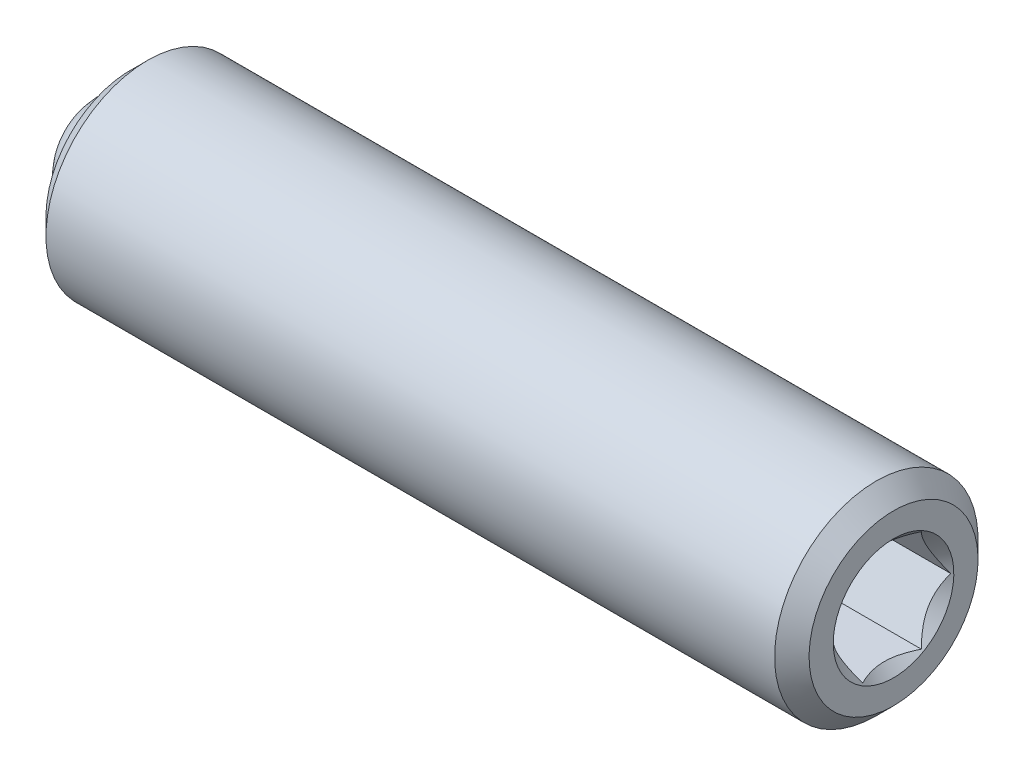
ISO-10303-21;
HEADER;
FILE_DESCRIPTION(('STEP AP214'),'2;1');
FILE_NAME('part.step','',(''),(''),'','','');
FILE_SCHEMA(('AUTOMOTIVE_DESIGN { 1 0 10303 214 1 1 1 1 }'));
ENDSEC;
DATA;
#1=APPLICATION_CONTEXT('core data for automotive mechanical design processes');
#2=APPLICATION_PROTOCOL_DEFINITION('international standard','automotive_design',2000,#1);
#3=PRODUCT_CONTEXT('',#1,'mechanical');
#4=PRODUCT('Part','Part','',(#3));
#5=PRODUCT_RELATED_PRODUCT_CATEGORY('part','',(#4));
#6=PRODUCT_DEFINITION_FORMATION('','',#4);
#7=PRODUCT_DEFINITION_CONTEXT('part definition',#1,'design');
#8=PRODUCT_DEFINITION('design','',#6,#7);
#9=PRODUCT_DEFINITION_SHAPE('','',#8);
#10=(LENGTH_UNIT() NAMED_UNIT(*) SI_UNIT(.MILLI.,.METRE.));
#11=(NAMED_UNIT(*) PLANE_ANGLE_UNIT() SI_UNIT($,.RADIAN.));
#12=(NAMED_UNIT(*) SI_UNIT($,.STERADIAN.) SOLID_ANGLE_UNIT());
#13=UNCERTAINTY_MEASURE_WITH_UNIT(LENGTH_MEASURE(1.E-05),#10,'distance_accuracy_value','');
#14=(GEOMETRIC_REPRESENTATION_CONTEXT(3) GLOBAL_UNCERTAINTY_ASSIGNED_CONTEXT((#13)) GLOBAL_UNIT_ASSIGNED_CONTEXT((#10,
#11,#12)) REPRESENTATION_CONTEXT('',''));
#15=CARTESIAN_POINT('',(0.,0.,0.));
#16=DIRECTION('',(0.,0.,1.));
#17=DIRECTION('',(1.,0.,0.));
#18=AXIS2_PLACEMENT_3D('',#15,#16,#17);
#19=CARTESIAN_POINT('',(-4.74327549159913,0.140112200938346,-0.203857779682182));
#20=DIRECTION('',(-1.,0.,0.));
#21=DIRECTION('',(0.,-1.,0.));
#22=AXIS2_PLACEMENT_3D('',#19,#20,#21);
#23=CONICAL_SURFACE('',#22,0.999490000000002,0.785398163397451);
#24=CARTESIAN_POINT('',(-3.74378549159914,0.140112200938346,-0.203857779682182));
#25=VERTEX_POINT('',#24);
#26=VERTEX_LOOP('',#25);
#27=FACE_BOUND('',#26,.T.);
#28=CARTESIAN_POINT('',(-4.74327549159913,0.140112200938346,-0.203857779682182));
#29=DIRECTION('',(-1.,0.,0.));
#30=DIRECTION('',(0.,-1.,0.));
#31=AXIS2_PLACEMENT_3D('',#28,#29,#30);
#32=CIRCLE('',#31,0.999490000000002);
#33=CARTESIAN_POINT('',(-4.74327549159913,-0.859377799061656,-0.203857779682182));
#34=VERTEX_POINT('',#33);
#35=EDGE_CURVE('P0_E29',#34,#34,#32,.T.);
#36=ORIENTED_EDGE('',*,*,#35,.T.);
#37=EDGE_LOOP('',(#36));
#38=FACE_BOUND('',#37,.T.);
#39=ADVANCED_FACE('P0_F17',(#27,#38),#23,.F.);
#40=CARTESIAN_POINT('',(5.83203219494458,0.140112200938348,-0.203857779682182));
#41=DIRECTION('',(-1.,0.,0.));
#42=DIRECTION('',(0.,-1.,0.));
#43=AXIS2_PLACEMENT_3D('',#40,#41,#42);
#44=PLANE('',#43);
#45=CARTESIAN_POINT('',(5.83203219494458,0.140112200938349,-0.203857779682182));
#46=DIRECTION('',(1.,0.,0.));
#47=DIRECTION('',(0.,1.,0.));
#48=AXIS2_PLACEMENT_3D('',#45,#46,#47);
#49=CIRCLE('',#48,0.889);
#50=CARTESIAN_POINT('',(5.83203219494458,1.02911220093835,-0.203857779682182));
#51=VERTEX_POINT('',#50);
#52=EDGE_CURVE('P0_E240',#51,#51,#49,.T.);
#53=ORIENTED_EDGE('',*,*,#52,.F.);
#54=EDGE_LOOP('',(#53));
#55=FACE_BOUND('',#54,.T.);
#56=CARTESIAN_POINT('',(5.83203219494458,0.140112200938349,-0.203857779682182));
#57=DIRECTION('',(-1.,0.,0.));
#58=DIRECTION('',(0.,-1.,0.));
#59=AXIS2_PLACEMENT_3D('',#56,#57,#58);
#60=CIRCLE('',#59,1.24599999999999);
#61=CARTESIAN_POINT('',(5.83203219494458,-1.10588779906164,-0.203857779682182));
#62=VERTEX_POINT('',#61);
#63=EDGE_CURVE('P0_E113',#62,#62,#60,.T.);
#64=ORIENTED_EDGE('',*,*,#63,.F.);
#65=EDGE_LOOP('',(#64));
#66=FACE_BOUND('',#65,.T.);
#67=ADVANCED_FACE('P0_F146',(#55,#66),#44,.F.);
#68=CARTESIAN_POINT('',(5.83203219494458,0.140112200938349,-0.203857779682182));
#69=DIRECTION('',(-1.,0.,0.));
#70=DIRECTION('',(0.,-1.,0.));
#71=AXIS2_PLACEMENT_3D('',#68,#69,#70);
#72=CONICAL_SURFACE('',#71,1.24599999999999,0.78539816339745);
#73=CARTESIAN_POINT('',(5.57803219494458,0.140112200938349,-0.203857779682182));
#74=DIRECTION('',(-1.,0.,0.));
#75=DIRECTION('',(0.,-1.,0.));
#76=AXIS2_PLACEMENT_3D('',#73,#74,#75);
#77=CIRCLE('',#76,1.49999999999999);
#78=CARTESIAN_POINT('',(5.57803219494458,-1.35988779906164,-0.203857779682182));
#79=VERTEX_POINT('',#78);
#80=EDGE_CURVE('P0_E110',#79,#79,#77,.T.);
#81=ORIENTED_EDGE('',*,*,#80,.F.);
#82=EDGE_LOOP('',(#81));
#83=FACE_BOUND('',#82,.T.);
#84=ORIENTED_EDGE('',*,*,#63,.T.);
#85=EDGE_LOOP('',(#84));
#86=FACE_BOUND('',#85,.T.);
#87=ADVANCED_FACE('P0_F140',(#83,#86),#72,.T.);
#88=CARTESIAN_POINT('',(-3.74378549159914,0.140112200938346,-0.203857779682182));
#89=DIRECTION('',(-1.,0.,0.));
#90=DIRECTION('',(0.,-1.,0.));
#91=AXIS2_PLACEMENT_3D('',#88,#89,#90);
#92=CYLINDRICAL_SURFACE('',#91,1.49999999999999);
#93=CARTESIAN_POINT('',(-5.16616780505542,0.140112200938346,-0.203857779682182));
#94=DIRECTION('',(-1.,0.,0.));
#95=DIRECTION('',(0.,-1.,0.));
#96=AXIS2_PLACEMENT_3D('',#93,#94,#95);
#97=CIRCLE('',#96,1.49999999999999);
#98=CARTESIAN_POINT('',(-5.16616780505542,-1.35988779906164,-0.203857779682182));
#99=VERTEX_POINT('',#98);
#100=EDGE_CURVE('P0_E107',#99,#99,#97,.T.);
#101=ORIENTED_EDGE('',*,*,#100,.F.);
#102=EDGE_LOOP('',(#101));
#103=FACE_BOUND('',#102,.T.);
#104=ORIENTED_EDGE('',*,*,#80,.T.);
#105=EDGE_LOOP('',(#104));
#106=FACE_BOUND('',#105,.T.);
#107=ADVANCED_FACE('P0_F134',(#103,#106),#92,.T.);
#108=CARTESIAN_POINT('',(-5.16616780505542,0.140112200938346,-0.203857779682182));
#109=DIRECTION('',(1.,0.,0.));
#110=DIRECTION('',(0.,1.,0.));
#111=AXIS2_PLACEMENT_3D('',#108,#109,#110);
#112=CONICAL_SURFACE('',#111,1.49999999999999,0.785398163397401);
#113=CARTESIAN_POINT('',(-5.42016780505542,0.140112200938346,-0.203857779682182));
#114=DIRECTION('',(-1.,0.,0.));
#115=DIRECTION('',(0.,-1.,0.));
#116=AXIS2_PLACEMENT_3D('',#113,#114,#115);
#117=CIRCLE('',#116,1.24600000000001);
#118=CARTESIAN_POINT('',(-5.42016780505542,-1.10588779906167,-0.203857779682182));
#119=VERTEX_POINT('',#118);
#120=EDGE_CURVE('P0_E104',#119,#119,#117,.T.);
#121=ORIENTED_EDGE('',*,*,#120,.F.);
#122=EDGE_LOOP('',(#121));
#123=FACE_BOUND('',#122,.T.);
#124=ORIENTED_EDGE('',*,*,#100,.T.);
#125=EDGE_LOOP('',(#124));
#126=FACE_BOUND('',#125,.T.);
#127=ADVANCED_FACE('P0_F128',(#123,#126),#112,.T.);
#128=CARTESIAN_POINT('',(-5.42016780505542,1.13960220093835,-0.203857779682182));
#129=DIRECTION('',(1.,0.,0.));
#130=DIRECTION('',(0.,1.,0.));
#131=AXIS2_PLACEMENT_3D('',#128,#129,#130);
#132=PLANE('',#131);
#133=CARTESIAN_POINT('',(-5.42016780505542,0.140112200938346,-0.203857779682182));
#134=DIRECTION('',(-1.,0.,0.));
#135=DIRECTION('',(0.,-1.,0.));
#136=AXIS2_PLACEMENT_3D('',#133,#134,#135);
#137=CIRCLE('',#136,0.99949);
#138=CARTESIAN_POINT('',(-5.42016780505542,-0.859377799061654,-0.203857779682182));
#139=VERTEX_POINT('',#138);
#140=EDGE_CURVE('P0_E101',#139,#139,#137,.T.);
#141=ORIENTED_EDGE('',*,*,#140,.F.);
#142=EDGE_LOOP('',(#141));
#143=FACE_BOUND('',#142,.T.);
#144=ORIENTED_EDGE('',*,*,#120,.T.);
#145=EDGE_LOOP('',(#144));
#146=FACE_BOUND('',#145,.T.);
#147=ADVANCED_FACE('P0_F122',(#143,#146),#132,.F.);
#148=CARTESIAN_POINT('',(-3.74378549159914,0.140112200938346,-0.203857779682182));
#149=DIRECTION('',(-1.,0.,0.));
#150=DIRECTION('',(0.,-1.,0.));
#151=AXIS2_PLACEMENT_3D('',#148,#149,#150);
#152=CYLINDRICAL_SURFACE('',#151,0.999490000000001);
#153=ORIENTED_EDGE('',*,*,#35,.F.);
#154=EDGE_LOOP('',(#153));
#155=FACE_BOUND('',#154,.T.);
#156=ORIENTED_EDGE('',*,*,#140,.T.);
#157=EDGE_LOOP('',(#156));
#158=FACE_BOUND('',#157,.T.);
#159=ADVANCED_FACE('P0_F119',(#155,#158),#152,.F.);
#160=CARTESIAN_POINT('',(5.83203219494458,0.140112200938349,-0.203857779682182));
#161=DIRECTION('',(1.,0.,0.));
#162=DIRECTION('',(0.,1.,0.));
#163=AXIS2_PLACEMENT_3D('',#160,#161,#162);
#164=CONICAL_SURFACE('',#163,0.889,0.78539816339745);
#165=ORIENTED_EDGE('',*,*,#52,.T.);
#166=EDGE_LOOP('',(#165));
#167=FACE_BOUND('',#166,.T.);
#168=CARTESIAN_POINT('',(5.80917309187379,0.140312200938349,0.662283094156095));
#169=CARTESIAN_POINT('',(5.79429170919294,0.114522238380668,0.647393252331027));
#170=CARTESIAN_POINT('',(5.78028386433598,0.0883009988096899,0.632254412606238));
#171=CARTESIAN_POINT('',(5.75463512341128,0.0348324927026426,0.601384356212167));
#172=CARTESIAN_POINT('',(5.74300851043469,0.00758013347777606,0.585650199277638));
#173=CARTESIAN_POINT('',(5.72309164450126,-0.0473731494430043,0.553922906590471));
#174=CARTESIAN_POINT('',(5.71475129281039,-0.0750600557571606,0.537937863776965));
#175=CARTESIAN_POINT('',(5.70190034069044,-0.131043394192504,0.505615868261186));
#176=CARTESIAN_POINT('',(5.69738013931786,-0.159338113905296,0.48927990421836));
#177=CARTESIAN_POINT('',(5.69330343182645,-0.208098088330494,0.461128319858293));
#178=CARTESIAN_POINT('',(5.6927003953431,-0.228499864717224,0.449349348769468));
#179=CARTESIAN_POINT('',(5.69371210474455,-0.269263933758011,0.425814202535505));
#180=CARTESIAN_POINT('',(5.69532733971905,-0.289626216713106,0.414058032990065));
#181=CARTESIAN_POINT('',(5.70339374570206,-0.350422342148475,0.378957373604269));
#182=CARTESIAN_POINT('',(5.71306653455674,-0.39055365405775,0.355787549870516));
#183=CARTESIAN_POINT('',(5.73641391670133,-0.460998199415677,0.315116372645176));
#184=CARTESIAN_POINT('',(5.74886615680127,-0.491641371070738,0.297424529241303));
#185=CARTESIAN_POINT('',(5.77691720895988,-0.551727144866442,0.262733991565886));
#186=CARTESIAN_POINT('',(5.79250578463277,-0.581173287443243,0.245733253222574));
#187=CARTESIAN_POINT('',(5.80917309187379,-0.610087799061652,0.229039452156199));
#188=B_SPLINE_CURVE_WITH_KNOTS('',3,(#168,#169,#170,#171,#172,#173,#174,#175,#176,#177,#178,
#179,#180,#181,#182,#183,#184,#185,#186,#187),.UNSPECIFIED.,.F.,.F.,(4,2,2,2,2,2,2,2,2,4),(0.,
0.0999419466095596,0.200466857654446,0.299393763705718,0.398071297300231,0.468665775681748,
0.539275821398839,0.680536257244566,0.792918418368075,0.904939568716033),.UNSPECIFIED.);
#189=CARTESIAN_POINT('',(5.80905759872902,0.140112200938349,0.662167624102257));
#190=VERTEX_POINT('',#189);
#191=CARTESIAN_POINT('',(5.80905759872902,-0.609887799061651,0.229154922210038));
#192=VERTEX_POINT('',#191);
#193=EDGE_CURVE('P0_E85',#190,#192,#188,.T.);
#194=ORIENTED_EDGE('',*,*,#193,.F.);
#195=CARTESIAN_POINT('',(5.80917309187379,0.890312200938349,0.2290394521562));
#196=CARTESIAN_POINT('',(5.79429170919294,0.864522238380668,0.243929293981268));
#197=CARTESIAN_POINT('',(5.78028386433598,0.83830099880969,0.259068133706057));
#198=CARTESIAN_POINT('',(5.75463512341128,0.784832492702643,0.289938190100128));
#199=CARTESIAN_POINT('',(5.74300851043469,0.757580133477776,0.305672347034657));
#200=CARTESIAN_POINT('',(5.72309164450126,0.702626850556996,0.337399639721823));
#201=CARTESIAN_POINT('',(5.71475129281039,0.67493994424284,0.353384682535329));
#202=CARTESIAN_POINT('',(5.70190034069044,0.618956605807496,0.385706678051109));
#203=CARTESIAN_POINT('',(5.69738013931786,0.590661886094704,0.402042642093934));
#204=CARTESIAN_POINT('',(5.69330343182645,0.541901911669506,0.430194226454002));
#205=CARTESIAN_POINT('',(5.6927003953431,0.521500135282777,0.441973197542826));
#206=CARTESIAN_POINT('',(5.69371210474455,0.480736066241989,0.46550834377679));
#207=CARTESIAN_POINT('',(5.69532733971905,0.460373783286894,0.477264513322229));
#208=CARTESIAN_POINT('',(5.70339374570206,0.399577657851525,0.512365172708026));
#209=CARTESIAN_POINT('',(5.71306653455674,0.35944634594225,0.535534996441778));
#210=CARTESIAN_POINT('',(5.73641391670133,0.289001800584323,0.576206173667118));
#211=CARTESIAN_POINT('',(5.74886615680127,0.258358628929262,0.593898017070992));
#212=CARTESIAN_POINT('',(5.77691720895988,0.198272855133559,0.628588554746408));
#213=CARTESIAN_POINT('',(5.79250578463277,0.168826712556757,0.64558929308972));
#214=CARTESIAN_POINT('',(5.80917309187379,0.139912200938348,0.662283094156096));
#215=B_SPLINE_CURVE_WITH_KNOTS('',3,(#195,#196,#197,#198,#199,#200,#201,#202,#203,#204,#205,
#206,#207,#208,#209,#210,#211,#212,#213,#214),.UNSPECIFIED.,.F.,.F.,(4,2,2,2,2,2,2,2,2,4),(0.,
0.0999419466095591,0.200466857654446,0.299393763705717,0.39807129730023,0.468665775681747,
0.539275821398839,0.680536257244566,0.792918418368074,0.904939568716033),.UNSPECIFIED.);
#216=CARTESIAN_POINT('',(5.80905759872902,0.890112200938349,0.229154922210038));
#217=VERTEX_POINT('',#216);
#218=EDGE_CURVE('P0_E195',#217,#190,#215,.T.);
#219=ORIENTED_EDGE('',*,*,#218,.F.);
#220=CARTESIAN_POINT('',(6.09890523014948,0.890112200938349,-1.08337041376642));
#221=CARTESIAN_POINT('',(6.08266583996229,0.890112200938349,-1.06202509160144));
#222=CARTESIAN_POINT('',(6.06658094832155,0.890112200938349,-1.04056255210855));
#223=CARTESIAN_POINT('',(6.03478442788256,0.890112200938349,-0.997354976592303));
#224=CARTESIAN_POINT('',(6.01907289085174,0.890112200938349,-0.975609873107702));
#225=CARTESIAN_POINT('',(5.97237032694948,0.890112200938349,-0.909560196047774));
#226=CARTESIAN_POINT('',(5.94206118480311,0.890112200938349,-0.864765498854594));
#227=CARTESIAN_POINT('',(5.88241320222156,0.890112200938349,-0.770727906275514));
#228=CARTESIAN_POINT('',(5.85323963432318,0.890112200938349,-0.72137897344189));
#229=CARTESIAN_POINT('',(5.79977118742681,0.890112200938349,-0.620199376934195));
#230=CARTESIAN_POINT('',(5.77545984365921,0.890112200938349,-0.568377850861364));
#231=CARTESIAN_POINT('',(5.74571542862337,0.890112200938349,-0.49073586771913));
#232=CARTESIAN_POINT('',(5.73720630681228,0.890112200938349,-0.466103184649244));
#233=CARTESIAN_POINT('',(5.7221584686847,0.890112200938349,-0.416242867271858));
#234=CARTESIAN_POINT('',(5.71561988378725,0.890112200938349,-0.391015193404165));
#235=CARTESIAN_POINT('',(5.69973942038636,0.890112200938349,-0.315512298631347));
#236=CARTESIAN_POINT('',(5.6937377219216,0.890112200938349,-0.264454169860129));
#237=CARTESIAN_POINT('',(5.69247143928522,0.890112200938349,-0.164196712147121));
#238=CARTESIAN_POINT('',(5.69679661297933,0.890112200938349,-0.115002678515325));
#239=CARTESIAN_POINT('',(5.70989492016502,0.890112200938349,-0.0420620616490273));
#240=CARTESIAN_POINT('',(5.71544548843791,0.890112200938349,-0.0176697554062032));
#241=CARTESIAN_POINT('',(5.72848130424814,0.890112200938349,0.0305909359781867));
#242=CARTESIAN_POINT('',(5.73596641021411,0.890112200938349,0.0544593593194067));
#243=CARTESIAN_POINT('',(5.76214643995754,0.890112200938349,0.128893354137778));
#244=CARTESIAN_POINT('',(5.78379505343843,0.890112200938349,0.178414114438126));
#245=CARTESIAN_POINT('',(5.83194603317959,0.890112200938349,0.275137718963044));
#246=CARTESIAN_POINT('',(5.85846569554728,0.890112200938349,0.322331518140768));
#247=CARTESIAN_POINT('',(5.91319918554311,0.890112200938349,0.412534674027944));
#248=CARTESIAN_POINT('',(5.94126415284714,0.890112200938349,0.45563552184839));
#249=CARTESIAN_POINT('',(5.98465857724785,0.890112200938349,0.519135833486404));
#250=CARTESIAN_POINT('',(5.99927812352786,0.890112200938349,0.540028947034259));
#251=CARTESIAN_POINT('',(6.02890624237324,0.890112200938349,0.581529174968722));
#252=CARTESIAN_POINT('',(6.04391470732033,0.890112200938349,0.602136366100391));
#253=CARTESIAN_POINT('',(6.05908451393215,0.890112200938349,0.622624391158504));
#254=B_SPLINE_CURVE_WITH_KNOTS('',3,(#220,#221,#222,#223,#224,#225,#226,#227,#228,#229,#230,
#231,#232,#233,#234,#235,#236,#237,#238,#239,#240,#241,#242,#243,#244,#245,#246,#247,#248,#249,
#250,#251,#252,#253),.UNSPECIFIED.,.F.,.F.,(4,2,2,2,2,2,2,2,2,2,2,2,2,2,2,2,4),(0.,
0.0804596117713111,0.160938799458303,0.323124453207641,0.494968571211659,0.666220542256046,
0.744331171691053,0.82244700932748,0.975597152071551,1.12276514370424,1.19774306448793,
1.27271549986629,1.43438364653569,1.59663734905404,1.75085876682927,1.82735598886284,
1.90383226462699),.UNSPECIFIED.);
#255=CARTESIAN_POINT('',(5.80905759872902,0.890112200938349,-0.636870481574401));
#256=VERTEX_POINT('',#255);
#257=EDGE_CURVE('P0_E190',#256,#217,#254,.T.);
#258=ORIENTED_EDGE('',*,*,#257,.F.);
#259=CARTESIAN_POINT('',(5.80917309187379,0.139912200938348,-1.06999865352046));
#260=CARTESIAN_POINT('',(5.79429170919294,0.165702163496029,-1.05510881169539));
#261=CARTESIAN_POINT('',(5.78028386433598,0.191923403067007,-1.0399699719706));
#262=CARTESIAN_POINT('',(5.75463512341128,0.245391909174054,-1.00909991557653));
#263=CARTESIAN_POINT('',(5.74300851043469,0.272644268398921,-0.993365758642001));
#264=CARTESIAN_POINT('',(5.72309164450126,0.327597551319701,-0.961638465954835));
#265=CARTESIAN_POINT('',(5.71475129281039,0.355284457633858,-0.945653423141329));
#266=CARTESIAN_POINT('',(5.70190034069044,0.411267796069202,-0.913331427625549));
#267=CARTESIAN_POINT('',(5.69738013931786,0.439562515781994,-0.896995463582724));
#268=CARTESIAN_POINT('',(5.69330343182645,0.488322490207193,-0.868843879222656));
#269=CARTESIAN_POINT('',(5.6927003953431,0.508724266593922,-0.857064908133831));
#270=CARTESIAN_POINT('',(5.69371210474455,0.549488335634709,-0.833529761899868));
#271=CARTESIAN_POINT('',(5.69532733971905,0.569850618589804,-0.821773592354429));
#272=CARTESIAN_POINT('',(5.70339374570206,0.630646744025173,-0.786672932968632));
#273=CARTESIAN_POINT('',(5.71306653455674,0.670778055934448,-0.763503109234879));
#274=CARTESIAN_POINT('',(5.73641391670133,0.741222601292375,-0.722831932009539));
#275=CARTESIAN_POINT('',(5.74886615680127,0.771865772947436,-0.705140088605666));
#276=CARTESIAN_POINT('',(5.77691720895988,0.831951546743139,-0.67044955093025));
#277=CARTESIAN_POINT('',(5.79250578463277,0.86139768931994,-0.653448812586938));
#278=CARTESIAN_POINT('',(5.80917309187379,0.890312200938349,-0.636755011520563));
#279=B_SPLINE_CURVE_WITH_KNOTS('',3,(#259,#260,#261,#262,#263,#264,#265,#266,#267,#268,#269,
#270,#271,#272,#273,#274,#275,#276,#277,#278),.UNSPECIFIED.,.F.,.F.,(4,2,2,2,2,2,2,2,2,4),(0.,
0.09994194660956,0.200466857654447,0.299393763705719,0.398071297300232,0.46866577568175,
0.539275821398841,0.680536257244568,0.792918418368075,0.904939568716033),.UNSPECIFIED.);
#280=CARTESIAN_POINT('',(5.80905759872902,0.140112200938349,-1.06988318346662));
#281=VERTEX_POINT('',#280);
#282=EDGE_CURVE('P0_E36',#281,#256,#279,.T.);
#283=ORIENTED_EDGE('',*,*,#282,.F.);
#284=CARTESIAN_POINT('',(5.80917309187379,-0.610087799061652,-0.636755011520563));
#285=CARTESIAN_POINT('',(5.79429170919294,-0.58429783650397,-0.65164485334563));
#286=CARTESIAN_POINT('',(5.78028386433598,-0.558076596932992,-0.66678369307042));
#287=CARTESIAN_POINT('',(5.75463512341128,-0.504608090825945,-0.697653749464491));
#288=CARTESIAN_POINT('',(5.74300851043469,-0.477355731601079,-0.71338790639902));
#289=CARTESIAN_POINT('',(5.72309164450126,-0.422402448680298,-0.745115199086187));
#290=CARTESIAN_POINT('',(5.71475129281039,-0.394715542366142,-0.761100241899693));
#291=CARTESIAN_POINT('',(5.70190034069045,-0.338732203930798,-0.793422237415472));
#292=CARTESIAN_POINT('',(5.69738013931786,-0.310437484218006,-0.809758201458298));
#293=CARTESIAN_POINT('',(5.69330343182645,-0.261677509792807,-0.837909785818366));
#294=CARTESIAN_POINT('',(5.6927003953431,-0.241275733406078,-0.84968875690719));
#295=CARTESIAN_POINT('',(5.69371210474455,-0.20051166436529,-0.873223903141154));
#296=CARTESIAN_POINT('',(5.69532733971905,-0.180149381410195,-0.884980072686593));
#297=CARTESIAN_POINT('',(5.70339374570206,-0.119353255974827,-0.920080732072389));
#298=CARTESIAN_POINT('',(5.71306653455674,-0.0792219440655513,-0.943250555806142));
#299=CARTESIAN_POINT('',(5.73641391670133,-0.0087773987076247,-0.983921733031482));
#300=CARTESIAN_POINT('',(5.74886615680127,0.0218657729474359,-1.00161357643536));
#301=CARTESIAN_POINT('',(5.77691720895988,0.081951546743139,-1.03630411411077));
#302=CARTESIAN_POINT('',(5.79250578463277,0.11139768931994,-1.05330485245408));
#303=CARTESIAN_POINT('',(5.80917309187379,0.140312200938349,-1.06999865352046));
#304=B_SPLINE_CURVE_WITH_KNOTS('',3,(#284,#285,#286,#287,#288,#289,#290,#291,#292,#293,#294,
#295,#296,#297,#298,#299,#300,#301,#302,#303),.UNSPECIFIED.,.F.,.F.,(4,2,2,2,2,2,2,2,2,4),(0.,
0.0999419466095599,0.200466857654447,0.299393763705719,0.398071297300232,0.46866577568175,
0.539275821398841,0.680536257244568,0.792918418368076,0.904939568716033),.UNSPECIFIED.);
#305=CARTESIAN_POINT('',(5.80905759872902,-0.609887799061651,-0.636870481574401));
#306=VERTEX_POINT('',#305);
#307=EDGE_CURVE('P0_E11',#306,#281,#304,.T.);
#308=ORIENTED_EDGE('',*,*,#307,.F.);
#309=CARTESIAN_POINT('',(6.09890523014948,-0.609887799061651,-1.08337041376642));
#310=CARTESIAN_POINT('',(6.08266583996229,-0.609887799061651,-1.06202509160145));
#311=CARTESIAN_POINT('',(6.06658094832155,-0.609887799061651,-1.04056255210855));
#312=CARTESIAN_POINT('',(6.03478442788256,-0.609887799061651,-0.997354976592305));
#313=CARTESIAN_POINT('',(6.01907289085175,-0.609887799061651,-0.975609873107703));
#314=CARTESIAN_POINT('',(5.97237032694948,-0.609887799061651,-0.909560196047775));
#315=CARTESIAN_POINT('',(5.94206118480311,-0.609887799061651,-0.864765498854596));
#316=CARTESIAN_POINT('',(5.88241320222156,-0.609887799061651,-0.770727906275515));
#317=CARTESIAN_POINT('',(5.85323963432318,-0.609887799061651,-0.721378973441891));
#318=CARTESIAN_POINT('',(5.79977118742681,-0.609887799061651,-0.620199376934195));
#319=CARTESIAN_POINT('',(5.77545984365921,-0.609887799061651,-0.568377850861365));
#320=CARTESIAN_POINT('',(5.74571542862338,-0.609887799061651,-0.490735867719131));
#321=CARTESIAN_POINT('',(5.73720630681228,-0.609887799061651,-0.466103184649244));
#322=CARTESIAN_POINT('',(5.7221584686847,-0.609887799061651,-0.416242867271859));
#323=CARTESIAN_POINT('',(5.71561988378725,-0.609887799061651,-0.391015193404165));
#324=CARTESIAN_POINT('',(5.69973942038636,-0.609887799061651,-0.315512298631347));
#325=CARTESIAN_POINT('',(5.6937377219216,-0.609887799061651,-0.264454169860129));
#326=CARTESIAN_POINT('',(5.69247143928522,-0.609887799061651,-0.16419671214712));
#327=CARTESIAN_POINT('',(5.69679661297933,-0.609887799061651,-0.115002678515325));
#328=CARTESIAN_POINT('',(5.70989492016502,-0.609887799061651,-0.0420620616490272));
#329=CARTESIAN_POINT('',(5.71544548843791,-0.609887799061651,-0.0176697554062033));
#330=CARTESIAN_POINT('',(5.72848130424814,-0.609887799061651,0.0305909359781867));
#331=CARTESIAN_POINT('',(5.73596641021411,-0.609887799061651,0.0544593593194067));
#332=CARTESIAN_POINT('',(5.76214643995754,-0.609887799061651,0.128893354137778));
#333=CARTESIAN_POINT('',(5.78379505343843,-0.609887799061651,0.178414114438125));
#334=CARTESIAN_POINT('',(5.83194603317959,-0.609887799061651,0.275137718963044));
#335=CARTESIAN_POINT('',(5.85846569554728,-0.609887799061651,0.322331518140768));
#336=CARTESIAN_POINT('',(5.91319918554311,-0.609887799061651,0.412534674027944));
#337=CARTESIAN_POINT('',(5.94126415284714,-0.609887799061651,0.45563552184839));
#338=CARTESIAN_POINT('',(5.98465857724785,-0.609887799061651,0.519135833486403));
#339=CARTESIAN_POINT('',(5.99927812352786,-0.609887799061651,0.540028947034259));
#340=CARTESIAN_POINT('',(6.02890624237324,-0.609887799061651,0.581529174968722));
#341=CARTESIAN_POINT('',(6.04391470732033,-0.609887799061651,0.602136366100391));
#342=CARTESIAN_POINT('',(6.05908451393215,-0.609887799061651,0.622624391158504));
#343=B_SPLINE_CURVE_WITH_KNOTS('',3,(#309,#310,#311,#312,#313,#314,#315,#316,#317,#318,#319,
#320,#321,#322,#323,#324,#325,#326,#327,#328,#329,#330,#331,#332,#333,#334,#335,#336,#337,#338,
#339,#340,#341,#342),.UNSPECIFIED.,.F.,.F.,(4,2,2,2,2,2,2,2,2,2,2,2,2,2,2,2,4),(0.,
0.0804596117713118,0.160938799458304,0.323124453207642,0.49496857121166,0.666220542256048,
0.744331171691054,0.822447009327482,0.975597152071553,1.12276514370424,1.19774306448793,
1.27271549986629,1.43438364653569,1.59663734905404,1.75085876682928,1.82735598886285,
1.90383226462699),.UNSPECIFIED.);
#344=EDGE_CURVE('P0_E72',#192,#306,#343,.F.);
#345=ORIENTED_EDGE('',*,*,#344,.F.);
#346=EDGE_LOOP('',(#194,#219,#258,#283,#308,#345));
#347=FACE_BOUND('',#346,.T.);
#348=ADVANCED_FACE('P0_F71',(#167,#347),#164,.F.);
#349=CARTESIAN_POINT('',(2.78403219494458,0.140112200938346,-0.203857779682182));
#350=DIRECTION('',(1.,0.,0.));
#351=DIRECTION('',(0.,0.,-1.));
#352=AXIS2_PLACEMENT_3D('',#349,#350,#351);
#353=PLANE('',#352);
#354=DIRECTION('',(0.,0.,-1.));
#355=VECTOR('',#354,1.);
#356=CARTESIAN_POINT('',(2.78403219494458,-0.609887799061652,0.229154922210037));
#357=LINE('',#356,#355);
#358=CARTESIAN_POINT('',(2.78403219494458,-0.609887799061652,0.229154922210037));
#359=VERTEX_POINT('',#358);
#360=CARTESIAN_POINT('',(2.78403219494458,-0.609887799061652,-0.636870481574401));
#361=VERTEX_POINT('',#360);
#362=EDGE_CURVE('P0_E84',#359,#361,#357,.T.);
#363=ORIENTED_EDGE('',*,*,#362,.T.);
#364=DIRECTION('',(0.,0.866025403784439,-0.5));
#365=VECTOR('',#364,1.);
#366=CARTESIAN_POINT('',(2.78403219494458,-0.609887799061652,-0.636870481574401));
#367=LINE('',#366,#365);
#368=CARTESIAN_POINT('',(2.78403219494458,0.140112200938348,-1.06988318346662));
#369=VERTEX_POINT('',#368);
#370=EDGE_CURVE('P0_E89',#361,#369,#367,.T.);
#371=ORIENTED_EDGE('',*,*,#370,.T.);
#372=DIRECTION('',(0.,0.866025403784438,0.5));
#373=VECTOR('',#372,1.);
#374=CARTESIAN_POINT('',(2.78403219494458,0.140112200938348,-1.06988318346662));
#375=LINE('',#374,#373);
#376=CARTESIAN_POINT('',(2.78403219494458,0.890112200938348,-0.636870481574401));
#377=VERTEX_POINT('',#376);
#378=EDGE_CURVE('P0_E220',#369,#377,#375,.T.);
#379=ORIENTED_EDGE('',*,*,#378,.T.);
#380=DIRECTION('',(0.,0.,1.));
#381=VECTOR('',#380,1.);
#382=CARTESIAN_POINT('',(2.78403219494458,0.890112200938348,-0.636870481574401));
#383=LINE('',#382,#381);
#384=CARTESIAN_POINT('',(2.78403219494458,0.890112200938348,0.229154922210038));
#385=VERTEX_POINT('',#384);
#386=EDGE_CURVE('P0_E224',#377,#385,#383,.T.);
#387=ORIENTED_EDGE('',*,*,#386,.T.);
#388=DIRECTION('',(0.,-0.866025403784439,0.5));
#389=VECTOR('',#388,1.);
#390=CARTESIAN_POINT('',(2.78403219494458,0.890112200938348,0.229154922210038));
#391=LINE('',#390,#389);
#392=CARTESIAN_POINT('',(2.78403219494458,0.140112200938348,0.662167624102257));
#393=VERTEX_POINT('',#392);
#394=EDGE_CURVE('P0_E97',#385,#393,#391,.T.);
#395=ORIENTED_EDGE('',*,*,#394,.T.);
#396=DIRECTION('',(0.,-0.866025403784438,-0.5));
#397=VECTOR('',#396,1.);
#398=CARTESIAN_POINT('',(2.78403219494458,0.140112200938348,0.662167624102257));
#399=LINE('',#398,#397);
#400=EDGE_CURVE('P0_E92',#393,#359,#399,.T.);
#401=ORIENTED_EDGE('',*,*,#400,.T.);
#402=EDGE_LOOP('',(#363,#371,#379,#387,#395,#401));
#403=FACE_BOUND('',#402,.T.);
#404=ADVANCED_FACE('P0_F177',(#403),#353,.T.);
#405=CARTESIAN_POINT('',(2.78403219494458,-0.609887799061652,-0.636870481574401));
#406=DIRECTION('',(0.,-0.5,-0.866025403784439));
#407=DIRECTION('',(0.,0.866025403784439,-0.5));
#408=AXIS2_PLACEMENT_3D('',#405,#406,#407);
#409=PLANE('',#408);
#410=DIRECTION('',(1.,0.,0.));
#411=VECTOR('',#410,1.);
#412=CARTESIAN_POINT('',(2.78403219494458,-0.609887799061652,-0.636870481574401));
#413=LINE('',#412,#411);
#414=EDGE_CURVE('P0_E81',#361,#306,#413,.T.);
#415=ORIENTED_EDGE('',*,*,#414,.T.);
#416=ORIENTED_EDGE('',*,*,#307,.T.);
#417=DIRECTION('',(1.,0.,0.));
#418=VECTOR('',#417,1.);
#419=CARTESIAN_POINT('',(2.78403219494458,0.140112200938348,-1.06988318346662));
#420=LINE('',#419,#418);
#421=EDGE_CURVE('P0_E91',#369,#281,#420,.T.);
#422=ORIENTED_EDGE('',*,*,#421,.F.);
#423=ORIENTED_EDGE('',*,*,#370,.F.);
#424=EDGE_LOOP('',(#415,#416,#422,#423));
#425=FACE_BOUND('',#424,.T.);
#426=ADVANCED_FACE('P0_F87',(#425),#409,.F.);
#427=CARTESIAN_POINT('',(2.78403219494458,0.140112200938348,-1.06988318346662));
#428=DIRECTION('',(0.,0.5,-0.866025403784438));
#429=DIRECTION('',(0.,0.866025403784439,0.5));
#430=AXIS2_PLACEMENT_3D('',#427,#428,#429);
#431=PLANE('',#430);
#432=ORIENTED_EDGE('',*,*,#421,.T.);
#433=ORIENTED_EDGE('',*,*,#282,.T.);
#434=DIRECTION('',(1.,0.,0.));
#435=VECTOR('',#434,1.);
#436=CARTESIAN_POINT('',(2.78403219494458,0.890112200938348,-0.636870481574401));
#437=LINE('',#436,#435);
#438=EDGE_CURVE('P0_E94',#377,#256,#437,.T.);
#439=ORIENTED_EDGE('',*,*,#438,.F.);
#440=ORIENTED_EDGE('',*,*,#378,.F.);
#441=EDGE_LOOP('',(#432,#433,#439,#440));
#442=FACE_BOUND('',#441,.T.);
#443=ADVANCED_FACE('P0_F209',(#442),#431,.F.);
#444=CARTESIAN_POINT('',(2.78403219494458,0.890112200938348,-0.636870481574401));
#445=DIRECTION('',(0.,1.,0.));
#446=DIRECTION('',(-1.,0.,0.));
#447=AXIS2_PLACEMENT_3D('',#444,#445,#446);
#448=PLANE('',#447);
#449=ORIENTED_EDGE('',*,*,#438,.T.);
#450=ORIENTED_EDGE('',*,*,#257,.T.);
#451=DIRECTION('',(1.,0.,0.));
#452=VECTOR('',#451,1.);
#453=CARTESIAN_POINT('',(2.78403219494458,0.890112200938348,0.229154922210038));
#454=LINE('',#453,#452);
#455=EDGE_CURVE('P0_E234',#385,#217,#454,.T.);
#456=ORIENTED_EDGE('',*,*,#455,.F.);
#457=ORIENTED_EDGE('',*,*,#386,.F.);
#458=EDGE_LOOP('',(#449,#450,#456,#457));
#459=FACE_BOUND('',#458,.T.);
#460=ADVANCED_FACE('P0_F204',(#459),#448,.F.);
#461=CARTESIAN_POINT('',(2.78403219494458,0.890112200938348,0.229154922210038));
#462=DIRECTION('',(0.,0.5,0.866025403784439));
#463=DIRECTION('',(0.,-0.866025403784439,0.5));
#464=AXIS2_PLACEMENT_3D('',#461,#462,#463);
#465=PLANE('',#464);
#466=ORIENTED_EDGE('',*,*,#455,.T.);
#467=ORIENTED_EDGE('',*,*,#218,.T.);
#468=DIRECTION('',(1.,0.,0.));
#469=VECTOR('',#468,1.);
#470=CARTESIAN_POINT('',(2.78403219494458,0.140112200938348,0.662167624102257));
#471=LINE('',#470,#469);
#472=EDGE_CURVE('P0_E231',#393,#190,#471,.T.);
#473=ORIENTED_EDGE('',*,*,#472,.F.);
#474=ORIENTED_EDGE('',*,*,#394,.F.);
#475=EDGE_LOOP('',(#466,#467,#473,#474));
#476=FACE_BOUND('',#475,.T.);
#477=ADVANCED_FACE('P0_F201',(#476),#465,.F.);
#478=CARTESIAN_POINT('',(2.78403219494458,0.140112200938348,0.662167624102257));
#479=DIRECTION('',(0.,-0.5,0.866025403784438));
#480=DIRECTION('',(0.,-0.866025403784439,-0.5));
#481=AXIS2_PLACEMENT_3D('',#478,#479,#480);
#482=PLANE('',#481);
#483=ORIENTED_EDGE('',*,*,#472,.T.);
#484=ORIENTED_EDGE('',*,*,#193,.T.);
#485=DIRECTION('',(1.,0.,0.));
#486=VECTOR('',#485,1.);
#487=CARTESIAN_POINT('',(2.78403219494458,-0.609887799061652,0.229154922210037));
#488=LINE('',#487,#486);
#489=EDGE_CURVE('P0_E83',#359,#192,#488,.T.);
#490=ORIENTED_EDGE('',*,*,#489,.F.);
#491=ORIENTED_EDGE('',*,*,#400,.F.);
#492=EDGE_LOOP('',(#483,#484,#490,#491));
#493=FACE_BOUND('',#492,.T.);
#494=ADVANCED_FACE('P0_F160',(#493),#482,.F.);
#495=CARTESIAN_POINT('',(2.78403219494458,-0.609887799061652,0.229154922210037));
#496=DIRECTION('',(0.,-1.,0.));
#497=DIRECTION('',(1.,0.,0.));
#498=AXIS2_PLACEMENT_3D('',#495,#496,#497);
#499=PLANE('',#498);
#500=ORIENTED_EDGE('',*,*,#489,.T.);
#501=ORIENTED_EDGE('',*,*,#344,.T.);
#502=ORIENTED_EDGE('',*,*,#414,.F.);
#503=ORIENTED_EDGE('',*,*,#362,.F.);
#504=EDGE_LOOP('',(#500,#501,#502,#503));
#505=FACE_BOUND('',#504,.T.);
#506=ADVANCED_FACE('P0_F79',(#505),#499,.F.);
#507=CLOSED_SHELL('',(#39,#67,#87,#107,#127,#147,#159,#348,#404,#426,#443,#460,#477,#494,#506));
#508=MANIFOLD_SOLID_BREP('P0_B1',#507);
#509=CARTESIAN_POINT('',(-5.15799622554508,0.140112200938347,-0.203857779682183));
#510=DIRECTION('',(1.,0.,0.));
#511=DIRECTION('',(0.,0.998481659177808,-0.0550851730099125));
#512=AXIS2_PLACEMENT_3D('',#509,#510,#511);
#513=SPHERICAL_SURFACE('',#512,0.999998);
#514=CARTESIAN_POINT('',(-5.15799622554508,0.140112200938347,-0.203857779682183));
#515=DIRECTION('',(0.,-0.0550851730099125,-0.998481659177808));
#516=DIRECTION('',(0.,0.998481659177808,-0.0550851730099125));
#517=AXIS2_PLACEMENT_3D('',#514,#515,#516);
#518=CIRCLE('',#517,0.999998);
#519=CARTESIAN_POINT('',(-5.15799622554508,1.13859186315284,-0.25894284252175));
#520=VERTEX_POINT('',#519);
#521=CARTESIAN_POINT('',(-5.15799622554508,-0.858367461276143,-0.148772716842617));
#522=VERTEX_POINT('',#521);
#523=EDGE_CURVE('P1_E33',#520,#522,#518,.T.);
#524=ORIENTED_EDGE('',*,*,#523,.T.);
#525=CARTESIAN_POINT('',(-5.15799622554508,0.140112200938347,-0.203857779682183));
#526=DIRECTION('',(1.,0.,0.));
#527=DIRECTION('',(0.,-0.0550851730099125,-0.998481659177808));
#528=AXIS2_PLACEMENT_3D('',#525,#526,#527);
#529=CIRCLE('',#528,0.999998);
#530=EDGE_CURVE('P1_E10',#522,#520,#529,.T.);
#531=ORIENTED_EDGE('',*,*,#530,.T.);
#532=EDGE_LOOP('',(#524,#531));
#533=FACE_BOUND('',#532,.T.);
#534=ADVANCED_FACE('P1_F16',(#533),#513,.T.);
#535=ORIENTED_EDGE('',*,*,#523,.F.);
#536=CARTESIAN_POINT('',(-5.15799622554508,0.140112200938347,-0.203857779682183));
#537=DIRECTION('',(1.,0.,0.));
#538=DIRECTION('',(0.,-0.0550851730099125,-0.998481659177808));
#539=AXIS2_PLACEMENT_3D('',#536,#537,#538);
#540=CIRCLE('',#539,0.999998);
#541=EDGE_CURVE('P1_E23',#520,#522,#540,.T.);
#542=ORIENTED_EDGE('',*,*,#541,.T.);
#543=EDGE_LOOP('',(#535,#542));
#544=FACE_BOUND('',#543,.T.);
#545=ADVANCED_FACE('P1_F40',(#544),#513,.T.);
#546=ORIENTED_EDGE('',*,*,#530,.F.);
#547=EDGE_CURVE('P1_E36',#522,#520,#518,.T.);
#548=ORIENTED_EDGE('',*,*,#547,.T.);
#549=EDGE_LOOP('',(#546,#548));
#550=FACE_BOUND('',#549,.T.);
#551=ADVANCED_FACE('P1_F38',(#550),#513,.T.);
#552=ORIENTED_EDGE('',*,*,#541,.F.);
#553=ORIENTED_EDGE('',*,*,#547,.F.);
#554=EDGE_LOOP('',(#552,#553));
#555=FACE_BOUND('',#554,.T.);
#556=ADVANCED_FACE('P1_F18',(#555),#513,.T.);
#557=CLOSED_SHELL('',(#534,#545,#551,#556));
#558=MANIFOLD_SOLID_BREP('P1_B1',#557);
#559=ADVANCED_BREP_SHAPE_REPRESENTATION('',(#18,#508,#558),#14);
#560=SHAPE_DEFINITION_REPRESENTATION(#9,#559);
ENDSEC;
END-ISO-10303-21;
